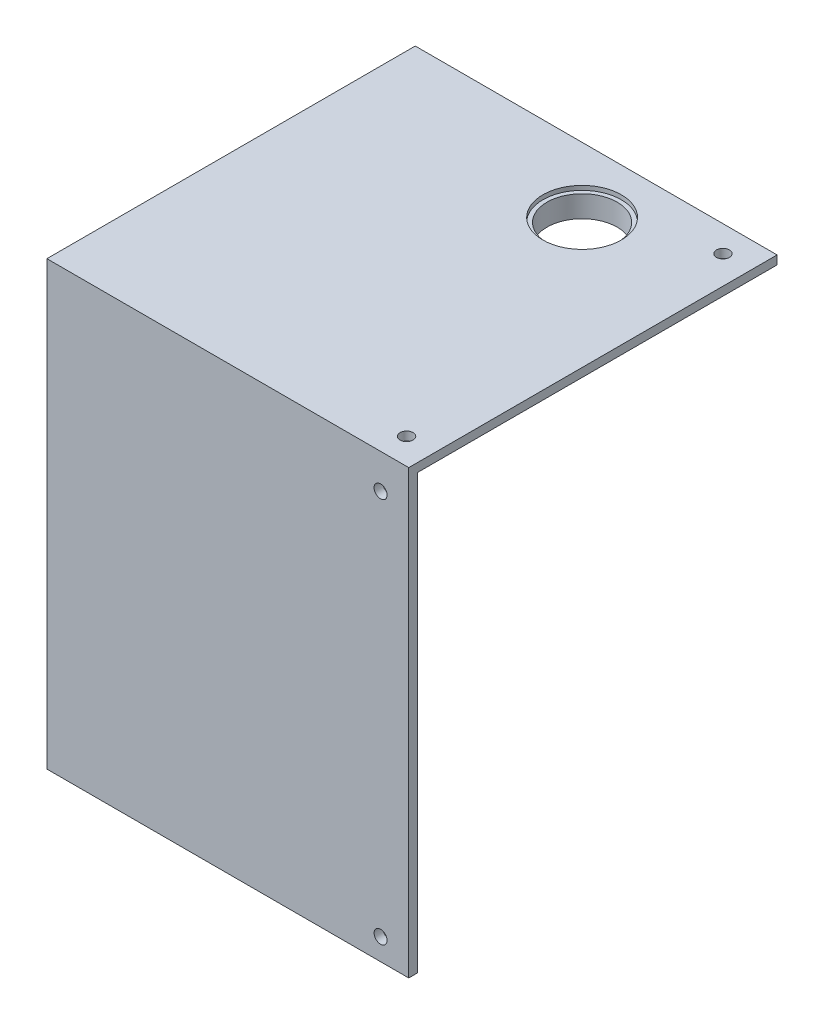
ISO-10303-21;
HEADER;
FILE_DESCRIPTION(('STEP AP214'),'2;1');
FILE_NAME('part.step','',(''),(''),'','','');
FILE_SCHEMA(('AUTOMOTIVE_DESIGN { 1 0 10303 214 1 1 1 1 }'));
ENDSEC;
DATA;
#1=APPLICATION_CONTEXT('core data for automotive mechanical design processes');
#2=APPLICATION_PROTOCOL_DEFINITION('international standard','automotive_design',2000,#1);
#3=PRODUCT_CONTEXT('',#1,'mechanical');
#4=PRODUCT('Part','Part','',(#3));
#5=PRODUCT_RELATED_PRODUCT_CATEGORY('part','',(#4));
#6=PRODUCT_DEFINITION_FORMATION('','',#4);
#7=PRODUCT_DEFINITION_CONTEXT('part definition',#1,'design');
#8=PRODUCT_DEFINITION('design','',#6,#7);
#9=PRODUCT_DEFINITION_SHAPE('','',#8);
#10=(LENGTH_UNIT() NAMED_UNIT(*) SI_UNIT(.MILLI.,.METRE.));
#11=(NAMED_UNIT(*) PLANE_ANGLE_UNIT() SI_UNIT($,.RADIAN.));
#12=(NAMED_UNIT(*) SI_UNIT($,.STERADIAN.) SOLID_ANGLE_UNIT());
#13=UNCERTAINTY_MEASURE_WITH_UNIT(LENGTH_MEASURE(1.E-05),#10,'distance_accuracy_value','');
#14=(GEOMETRIC_REPRESENTATION_CONTEXT(3) GLOBAL_UNCERTAINTY_ASSIGNED_CONTEXT((#13)) GLOBAL_UNIT_ASSIGNED_CONTEXT((#10,
#11,#12)) REPRESENTATION_CONTEXT('',''));
#15=CARTESIAN_POINT('',(0.,0.,0.));
#16=DIRECTION('',(0.,0.,1.));
#17=DIRECTION('',(1.,0.,0.));
#18=AXIS2_PLACEMENT_3D('',#15,#16,#17);
#19=CARTESIAN_POINT('',(11.75,2.,-27.5));
#20=DIRECTION('',(0.,-1.,0.));
#21=DIRECTION('',(0.,0.,-1.));
#22=AXIS2_PLACEMENT_3D('',#19,#20,#21);
#23=CYLINDRICAL_SURFACE('',#22,8.1);
#24=CARTESIAN_POINT('',(11.75,-4.,-27.5));
#25=DIRECTION('',(0.,-1.,0.));
#26=DIRECTION('',(0.,0.,-1.));
#27=AXIS2_PLACEMENT_3D('',#24,#25,#26);
#28=CIRCLE('',#27,8.1);
#29=CARTESIAN_POINT('',(11.75,-4.,-35.6));
#30=VERTEX_POINT('',#29);
#31=EDGE_CURVE('E160',#30,#30,#28,.T.);
#32=ORIENTED_EDGE('',*,*,#31,.T.);
#33=EDGE_LOOP('',(#32));
#34=FACE_BOUND('',#33,.T.);
#35=CARTESIAN_POINT('',(11.75,1.,-27.5));
#36=DIRECTION('',(0.,1.,0.));
#37=DIRECTION('',(0.,0.,1.));
#38=AXIS2_PLACEMENT_3D('',#35,#36,#37);
#39=CIRCLE('',#38,8.1);
#40=CARTESIAN_POINT('',(11.75,1.,-19.4));
#41=VERTEX_POINT('',#40);
#42=EDGE_CURVE('E45',#41,#41,#39,.F.);
#43=ORIENTED_EDGE('',*,*,#42,.F.);
#44=EDGE_LOOP('',(#43));
#45=FACE_BOUND('',#44,.T.);
#46=ADVANCED_FACE('F41',(#34,#45),#23,.F.);
#47=CARTESIAN_POINT('',(41.75,2.,42.5));
#48=DIRECTION('',(-1.,0.,0.));
#49=DIRECTION('',(0.,0.,1.));
#50=AXIS2_PLACEMENT_3D('',#47,#48,#49);
#51=PLANE('',#50);
#52=DIRECTION('',(0.,-1.,0.));
#53=VECTOR('',#52,1.);
#54=CARTESIAN_POINT('',(41.75,2.,42.5));
#55=LINE('',#54,#53);
#56=CARTESIAN_POINT('',(41.75,2.,42.5));
#57=VERTEX_POINT('',#56);
#58=CARTESIAN_POINT('',(41.75,-100.,42.5));
#59=VERTEX_POINT('',#58);
#60=EDGE_CURVE('E148',#57,#59,#55,.T.);
#61=ORIENTED_EDGE('',*,*,#60,.T.);
#62=DIRECTION('',(0.,0.,1.));
#63=VECTOR('',#62,1.);
#64=CARTESIAN_POINT('',(41.75,-100.,42.5));
#65=LINE('',#64,#63);
#66=CARTESIAN_POINT('',(41.75,-100.,40.5));
#67=VERTEX_POINT('',#66);
#68=EDGE_CURVE('E116',#67,#59,#65,.T.);
#69=ORIENTED_EDGE('',*,*,#68,.F.);
#70=DIRECTION('',(0.,1.,0.));
#71=VECTOR('',#70,1.);
#72=CARTESIAN_POINT('',(41.75,-100.,40.5));
#73=LINE('',#72,#71);
#74=CARTESIAN_POINT('',(41.75,0.,40.5));
#75=VERTEX_POINT('',#74);
#76=EDGE_CURVE('E111',#67,#75,#73,.T.);
#77=ORIENTED_EDGE('',*,*,#76,.T.);
#78=DIRECTION('',(0.,0.,-1.));
#79=VECTOR('',#78,1.);
#80=CARTESIAN_POINT('',(41.75,0.,42.5));
#81=LINE('',#80,#79);
#82=CARTESIAN_POINT('',(41.75,0.,-42.5));
#83=VERTEX_POINT('',#82);
#84=EDGE_CURVE('E131',#75,#83,#81,.T.);
#85=ORIENTED_EDGE('',*,*,#84,.T.);
#86=DIRECTION('',(0.,-1.,0.));
#87=VECTOR('',#86,1.);
#88=CARTESIAN_POINT('',(41.75,2.,-42.5));
#89=LINE('',#88,#87);
#90=CARTESIAN_POINT('',(41.75,2.,-42.5));
#91=VERTEX_POINT('',#90);
#92=EDGE_CURVE('E11',#91,#83,#89,.T.);
#93=ORIENTED_EDGE('',*,*,#92,.F.);
#94=DIRECTION('',(0.,0.,-1.));
#95=VECTOR('',#94,1.);
#96=CARTESIAN_POINT('',(41.75,2.,42.5));
#97=LINE('',#96,#95);
#98=EDGE_CURVE('E139',#57,#91,#97,.T.);
#99=ORIENTED_EDGE('',*,*,#98,.F.);
#100=EDGE_LOOP('',(#61,#69,#77,#85,#93,#99));
#101=FACE_BOUND('',#100,.T.);
#102=ADVANCED_FACE('F43',(#101),#51,.F.);
#103=CARTESIAN_POINT('',(-41.75,2.,-42.5));
#104=DIRECTION('',(0.,0.,1.));
#105=DIRECTION('',(1.,0.,0.));
#106=AXIS2_PLACEMENT_3D('',#103,#104,#105);
#107=PLANE('',#106);
#108=DIRECTION('',(-1.,0.,0.));
#109=VECTOR('',#108,1.);
#110=CARTESIAN_POINT('',(-41.75,0.,-42.5));
#111=LINE('',#110,#109);
#112=CARTESIAN_POINT('',(-41.75,0.,-42.5));
#113=VERTEX_POINT('',#112);
#114=EDGE_CURVE('E83',#83,#113,#111,.T.);
#115=ORIENTED_EDGE('',*,*,#114,.T.);
#116=DIRECTION('',(0.,-1.,0.));
#117=VECTOR('',#116,1.);
#118=CARTESIAN_POINT('',(-41.75,2.,-42.5));
#119=LINE('',#118,#117);
#120=CARTESIAN_POINT('',(-41.75,2.,-42.5));
#121=VERTEX_POINT('',#120);
#122=EDGE_CURVE('E51',#121,#113,#119,.T.);
#123=ORIENTED_EDGE('',*,*,#122,.F.);
#124=DIRECTION('',(-1.,0.,0.));
#125=VECTOR('',#124,1.);
#126=CARTESIAN_POINT('',(-41.75,2.,-42.5));
#127=LINE('',#126,#125);
#128=EDGE_CURVE('E88',#91,#121,#127,.T.);
#129=ORIENTED_EDGE('',*,*,#128,.F.);
#130=ORIENTED_EDGE('',*,*,#92,.T.);
#131=EDGE_LOOP('',(#115,#123,#129,#130));
#132=FACE_BOUND('',#131,.T.);
#133=ADVANCED_FACE('F203',(#132),#107,.F.);
#134=CARTESIAN_POINT('',(-41.75,2.,42.5));
#135=DIRECTION('',(1.,0.,0.));
#136=DIRECTION('',(0.,0.,-1.));
#137=AXIS2_PLACEMENT_3D('',#134,#135,#136);
#138=PLANE('',#137);
#139=DIRECTION('',(0.,0.,1.));
#140=VECTOR('',#139,1.);
#141=CARTESIAN_POINT('',(-41.75,0.,42.5));
#142=LINE('',#141,#140);
#143=CARTESIAN_POINT('',(-41.75,0.,40.5));
#144=VERTEX_POINT('',#143);
#145=EDGE_CURVE('E129',#113,#144,#142,.T.);
#146=ORIENTED_EDGE('',*,*,#145,.T.);
#147=DIRECTION('',(0.,1.,0.));
#148=VECTOR('',#147,1.);
#149=CARTESIAN_POINT('',(-41.75,-100.,40.5));
#150=LINE('',#149,#148);
#151=CARTESIAN_POINT('',(-41.75,-100.,40.5));
#152=VERTEX_POINT('',#151);
#153=EDGE_CURVE('E109',#152,#144,#150,.T.);
#154=ORIENTED_EDGE('',*,*,#153,.F.);
#155=DIRECTION('',(0.,0.,-1.));
#156=VECTOR('',#155,1.);
#157=CARTESIAN_POINT('',(-41.75,-100.,42.5));
#158=LINE('',#157,#156);
#159=CARTESIAN_POINT('',(-41.75,-100.,42.5));
#160=VERTEX_POINT('',#159);
#161=EDGE_CURVE('E117',#160,#152,#158,.T.);
#162=ORIENTED_EDGE('',*,*,#161,.F.);
#163=DIRECTION('',(0.,-1.,0.));
#164=VECTOR('',#163,1.);
#165=CARTESIAN_POINT('',(-41.75,2.,42.5));
#166=LINE('',#165,#164);
#167=CARTESIAN_POINT('',(-41.75,2.,42.5));
#168=VERTEX_POINT('',#167);
#169=EDGE_CURVE('E156',#168,#160,#166,.T.);
#170=ORIENTED_EDGE('',*,*,#169,.F.);
#171=DIRECTION('',(0.,0.,1.));
#172=VECTOR('',#171,1.);
#173=CARTESIAN_POINT('',(-41.75,2.,42.5));
#174=LINE('',#173,#172);
#175=EDGE_CURVE('E144',#121,#168,#174,.T.);
#176=ORIENTED_EDGE('',*,*,#175,.F.);
#177=ORIENTED_EDGE('',*,*,#122,.T.);
#178=EDGE_LOOP('',(#146,#154,#162,#170,#176,#177));
#179=FACE_BOUND('',#178,.T.);
#180=ADVANCED_FACE('F128',(#179),#138,.F.);
#181=CARTESIAN_POINT('',(-41.75,2.,42.5));
#182=DIRECTION('',(0.,0.,-1.));
#183=DIRECTION('',(-1.,0.,0.));
#184=AXIS2_PLACEMENT_3D('',#181,#182,#183);
#185=PLANE('',#184);
#186=CARTESIAN_POINT('',(35.25,-95.,42.5));
#187=DIRECTION('',(0.,0.,1.));
#188=DIRECTION('',(1.,0.,0.));
#189=AXIS2_PLACEMENT_3D('',#186,#187,#188);
#190=CIRCLE('',#189,1.5);
#191=CARTESIAN_POINT('',(36.75,-95.,42.5));
#192=VERTEX_POINT('',#191);
#193=EDGE_CURVE('E247',#192,#192,#190,.T.);
#194=ORIENTED_EDGE('',*,*,#193,.F.);
#195=EDGE_LOOP('',(#194));
#196=FACE_BOUND('',#195,.T.);
#197=CARTESIAN_POINT('',(35.25,-6.,42.5));
#198=DIRECTION('',(0.,0.,1.));
#199=DIRECTION('',(1.,0.,0.));
#200=AXIS2_PLACEMENT_3D('',#197,#198,#199);
#201=CIRCLE('',#200,1.5);
#202=CARTESIAN_POINT('',(36.75,-6.,42.5));
#203=VERTEX_POINT('',#202);
#204=EDGE_CURVE('E250',#203,#203,#201,.T.);
#205=ORIENTED_EDGE('',*,*,#204,.F.);
#206=EDGE_LOOP('',(#205));
#207=FACE_BOUND('',#206,.T.);
#208=ORIENTED_EDGE('',*,*,#169,.T.);
#209=DIRECTION('',(-1.,0.,0.));
#210=VECTOR('',#209,1.);
#211=CARTESIAN_POINT('',(-41.75,-100.,42.5));
#212=LINE('',#211,#210);
#213=EDGE_CURVE('E123',#59,#160,#212,.T.);
#214=ORIENTED_EDGE('',*,*,#213,.F.);
#215=ORIENTED_EDGE('',*,*,#60,.F.);
#216=DIRECTION('',(1.,0.,0.));
#217=VECTOR('',#216,1.);
#218=CARTESIAN_POINT('',(-41.75,2.,42.5));
#219=LINE('',#218,#217);
#220=EDGE_CURVE('E68',#168,#57,#219,.T.);
#221=ORIENTED_EDGE('',*,*,#220,.F.);
#222=EDGE_LOOP('',(#208,#214,#215,#221));
#223=FACE_BOUND('',#222,.T.);
#224=ADVANCED_FACE('F200',(#196,#207,#223),#185,.F.);
#225=CARTESIAN_POINT('',(0.,2.,0.));
#226=DIRECTION('',(0.,-1.,0.));
#227=DIRECTION('',(0.,0.,-1.));
#228=AXIS2_PLACEMENT_3D('',#225,#226,#227);
#229=PLANE('',#228);
#230=CARTESIAN_POINT('',(35.25,2.,36.5));
#231=DIRECTION('',(0.,1.,0.));
#232=DIRECTION('',(0.,0.,1.));
#233=AXIS2_PLACEMENT_3D('',#230,#231,#232);
#234=CIRCLE('',#233,1.5);
#235=CARTESIAN_POINT('',(35.25,2.,38.));
#236=VERTEX_POINT('',#235);
#237=EDGE_CURVE('E253',#236,#236,#234,.T.);
#238=ORIENTED_EDGE('',*,*,#237,.F.);
#239=EDGE_LOOP('',(#238));
#240=FACE_BOUND('',#239,.T.);
#241=CARTESIAN_POINT('',(35.25,2.,-36.5));
#242=DIRECTION('',(0.,1.,0.));
#243=DIRECTION('',(0.,0.,1.));
#244=AXIS2_PLACEMENT_3D('',#241,#242,#243);
#245=CIRCLE('',#244,1.5);
#246=CARTESIAN_POINT('',(35.25,2.,-35.));
#247=VERTEX_POINT('',#246);
#248=EDGE_CURVE('E270',#247,#247,#245,.T.);
#249=ORIENTED_EDGE('',*,*,#248,.F.);
#250=EDGE_LOOP('',(#249));
#251=FACE_BOUND('',#250,.T.);
#252=CARTESIAN_POINT('',(11.75,2.,-27.5));
#253=DIRECTION('',(0.,1.,0.));
#254=DIRECTION('',(0.,0.,1.));
#255=AXIS2_PLACEMENT_3D('',#252,#253,#254);
#256=CIRCLE('',#255,9.05);
#257=CARTESIAN_POINT('',(11.75,2.,-18.45));
#258=VERTEX_POINT('',#257);
#259=EDGE_CURVE('E177',#258,#258,#256,.T.);
#260=ORIENTED_EDGE('',*,*,#259,.F.);
#261=EDGE_LOOP('',(#260));
#262=FACE_BOUND('',#261,.T.);
#263=ORIENTED_EDGE('',*,*,#98,.T.);
#264=ORIENTED_EDGE('',*,*,#128,.T.);
#265=ORIENTED_EDGE('',*,*,#175,.T.);
#266=ORIENTED_EDGE('',*,*,#220,.T.);
#267=EDGE_LOOP('',(#263,#264,#265,#266));
#268=FACE_BOUND('',#267,.T.);
#269=ADVANCED_FACE('F202',(#240,#251,#262,#268),#229,.F.);
#270=CARTESIAN_POINT('',(0.,0.,0.));
#271=DIRECTION('',(0.,-1.,0.));
#272=DIRECTION('',(0.,0.,-1.));
#273=AXIS2_PLACEMENT_3D('',#270,#271,#272);
#274=PLANE('',#273);
#275=CARTESIAN_POINT('',(35.25,0.,36.5));
#276=DIRECTION('',(0.,-1.,0.));
#277=DIRECTION('',(0.,0.,-1.));
#278=AXIS2_PLACEMENT_3D('',#275,#276,#277);
#279=CIRCLE('',#278,1.5);
#280=CARTESIAN_POINT('',(35.25,0.,35.));
#281=VERTEX_POINT('',#280);
#282=EDGE_CURVE('E258',#281,#281,#279,.F.);
#283=ORIENTED_EDGE('',*,*,#282,.T.);
#284=EDGE_LOOP('',(#283));
#285=FACE_BOUND('',#284,.T.);
#286=CARTESIAN_POINT('',(35.25,0.,-36.5));
#287=DIRECTION('',(0.,-1.,0.));
#288=DIRECTION('',(0.,0.,-1.));
#289=AXIS2_PLACEMENT_3D('',#286,#287,#288);
#290=CIRCLE('',#289,1.5);
#291=CARTESIAN_POINT('',(35.25,0.,-38.));
#292=VERTEX_POINT('',#291);
#293=EDGE_CURVE('E266',#292,#292,#290,.F.);
#294=ORIENTED_EDGE('',*,*,#293,.T.);
#295=EDGE_LOOP('',(#294));
#296=FACE_BOUND('',#295,.T.);
#297=CARTESIAN_POINT('',(11.75,0.,-27.5));
#298=DIRECTION('',(0.,-1.,0.));
#299=DIRECTION('',(0.,0.,-1.));
#300=AXIS2_PLACEMENT_3D('',#297,#298,#299);
#301=CIRCLE('',#300,10.6);
#302=CARTESIAN_POINT('',(11.75,0.,-38.1));
#303=VERTEX_POINT('',#302);
#304=EDGE_CURVE('E163',#303,#303,#301,.T.);
#305=ORIENTED_EDGE('',*,*,#304,.F.);
#306=EDGE_LOOP('',(#305));
#307=FACE_BOUND('',#306,.T.);
#308=DIRECTION('',(1.,0.,0.));
#309=VECTOR('',#308,1.);
#310=CARTESIAN_POINT('',(-41.75,0.,40.5));
#311=LINE('',#310,#309);
#312=EDGE_CURVE('E59',#144,#75,#311,.T.);
#313=ORIENTED_EDGE('',*,*,#312,.F.);
#314=ORIENTED_EDGE('',*,*,#145,.F.);
#315=ORIENTED_EDGE('',*,*,#114,.F.);
#316=ORIENTED_EDGE('',*,*,#84,.F.);
#317=EDGE_LOOP('',(#313,#314,#315,#316));
#318=FACE_BOUND('',#317,.T.);
#319=ADVANCED_FACE('F232',(#285,#296,#307,#318),#274,.T.);
#320=CARTESIAN_POINT('',(-41.75,-100.,40.5));
#321=DIRECTION('',(0.,0.,1.));
#322=DIRECTION('',(1.,0.,0.));
#323=AXIS2_PLACEMENT_3D('',#320,#321,#322);
#324=PLANE('',#323);
#325=CARTESIAN_POINT('',(35.25,-95.,40.5));
#326=DIRECTION('',(0.,0.,1.));
#327=DIRECTION('',(1.,0.,0.));
#328=AXIS2_PLACEMENT_3D('',#325,#326,#327);
#329=CIRCLE('',#328,1.5);
#330=CARTESIAN_POINT('',(36.75,-95.,40.5));
#331=VERTEX_POINT('',#330);
#332=EDGE_CURVE('E183',#331,#331,#329,.F.);
#333=ORIENTED_EDGE('',*,*,#332,.F.);
#334=EDGE_LOOP('',(#333));
#335=FACE_BOUND('',#334,.T.);
#336=CARTESIAN_POINT('',(35.25,-6.,40.5));
#337=DIRECTION('',(0.,0.,1.));
#338=DIRECTION('',(1.,0.,0.));
#339=AXIS2_PLACEMENT_3D('',#336,#337,#338);
#340=CIRCLE('',#339,1.5);
#341=CARTESIAN_POINT('',(36.75,-6.,40.5));
#342=VERTEX_POINT('',#341);
#343=EDGE_CURVE('E186',#342,#342,#340,.F.);
#344=ORIENTED_EDGE('',*,*,#343,.F.);
#345=EDGE_LOOP('',(#344));
#346=FACE_BOUND('',#345,.T.);
#347=ORIENTED_EDGE('',*,*,#312,.T.);
#348=ORIENTED_EDGE('',*,*,#76,.F.);
#349=DIRECTION('',(1.,0.,0.));
#350=VECTOR('',#349,1.);
#351=CARTESIAN_POINT('',(-41.75,-100.,40.5));
#352=LINE('',#351,#350);
#353=EDGE_CURVE('E105',#152,#67,#352,.T.);
#354=ORIENTED_EDGE('',*,*,#353,.F.);
#355=ORIENTED_EDGE('',*,*,#153,.T.);
#356=EDGE_LOOP('',(#347,#348,#354,#355));
#357=FACE_BOUND('',#356,.T.);
#358=ADVANCED_FACE('F107',(#335,#346,#357),#324,.F.);
#359=CARTESIAN_POINT('',(0.,-100.,0.));
#360=DIRECTION('',(0.,-1.,0.));
#361=DIRECTION('',(0.,0.,-1.));
#362=AXIS2_PLACEMENT_3D('',#359,#360,#361);
#363=PLANE('',#362);
#364=ORIENTED_EDGE('',*,*,#161,.T.);
#365=ORIENTED_EDGE('',*,*,#353,.T.);
#366=ORIENTED_EDGE('',*,*,#68,.T.);
#367=ORIENTED_EDGE('',*,*,#213,.T.);
#368=EDGE_LOOP('',(#364,#365,#366,#367));
#369=FACE_BOUND('',#368,.T.);
#370=ADVANCED_FACE('F121',(#369),#363,.T.);
#371=CARTESIAN_POINT('',(11.75,-4.,-27.5));
#372=DIRECTION('',(0.,1.,0.));
#373=DIRECTION('',(0.,0.,1.));
#374=AXIS2_PLACEMENT_3D('',#371,#372,#373);
#375=CYLINDRICAL_SURFACE('',#374,10.6);
#376=CARTESIAN_POINT('',(11.75,-4.,-27.5));
#377=DIRECTION('',(0.,-1.,0.));
#378=DIRECTION('',(0.,0.,-1.));
#379=AXIS2_PLACEMENT_3D('',#376,#377,#378);
#380=CIRCLE('',#379,10.6);
#381=CARTESIAN_POINT('',(11.75,-4.,-38.1));
#382=VERTEX_POINT('',#381);
#383=EDGE_CURVE('E169',#382,#382,#380,.T.);
#384=ORIENTED_EDGE('',*,*,#383,.F.);
#385=EDGE_LOOP('',(#384));
#386=FACE_BOUND('',#385,.T.);
#387=ORIENTED_EDGE('',*,*,#304,.T.);
#388=EDGE_LOOP('',(#387));
#389=FACE_BOUND('',#388,.T.);
#390=ADVANCED_FACE('F223',(#386,#389),#375,.T.);
#391=CARTESIAN_POINT('',(0.,-4.,0.));
#392=DIRECTION('',(0.,-1.,0.));
#393=DIRECTION('',(0.,0.,-1.));
#394=AXIS2_PLACEMENT_3D('',#391,#392,#393);
#395=PLANE('',#394);
#396=ORIENTED_EDGE('',*,*,#31,.F.);
#397=EDGE_LOOP('',(#396));
#398=FACE_BOUND('',#397,.T.);
#399=ORIENTED_EDGE('',*,*,#383,.T.);
#400=EDGE_LOOP('',(#399));
#401=FACE_BOUND('',#400,.T.);
#402=ADVANCED_FACE('F219',(#398,#401),#395,.T.);
#403=CARTESIAN_POINT('',(11.75,1.,-27.5));
#404=DIRECTION('',(0.,1.,0.));
#405=DIRECTION('',(0.,0.,1.));
#406=AXIS2_PLACEMENT_3D('',#403,#404,#405);
#407=PLANE('',#406);
#408=CARTESIAN_POINT('',(11.75,1.,-27.5));
#409=DIRECTION('',(0.,1.,0.));
#410=DIRECTION('',(0.,0.,1.));
#411=AXIS2_PLACEMENT_3D('',#408,#409,#410);
#412=CIRCLE('',#411,9.05);
#413=CARTESIAN_POINT('',(11.75,1.,-18.45));
#414=VERTEX_POINT('',#413);
#415=EDGE_CURVE('E172',#414,#414,#412,.T.);
#416=ORIENTED_EDGE('',*,*,#415,.T.);
#417=EDGE_LOOP('',(#416));
#418=FACE_BOUND('',#417,.T.);
#419=ORIENTED_EDGE('',*,*,#42,.T.);
#420=EDGE_LOOP('',(#419));
#421=FACE_BOUND('',#420,.T.);
#422=ADVANCED_FACE('F222',(#418,#421),#407,.T.);
#423=CARTESIAN_POINT('',(11.75,1.,-27.5));
#424=DIRECTION('',(0.,1.,0.));
#425=DIRECTION('',(0.,0.,1.));
#426=AXIS2_PLACEMENT_3D('',#423,#424,#425);
#427=CYLINDRICAL_SURFACE('',#426,9.05);
#428=ORIENTED_EDGE('',*,*,#415,.F.);
#429=EDGE_LOOP('',(#428));
#430=FACE_BOUND('',#429,.T.);
#431=ORIENTED_EDGE('',*,*,#259,.T.);
#432=EDGE_LOOP('',(#431));
#433=FACE_BOUND('',#432,.T.);
#434=ADVANCED_FACE('F217',(#430,#433),#427,.F.);
#435=CARTESIAN_POINT('',(35.25,-6.,-42.501));
#436=DIRECTION('',(0.,0.,1.));
#437=DIRECTION('',(1.,0.,0.));
#438=AXIS2_PLACEMENT_3D('',#435,#436,#437);
#439=CYLINDRICAL_SURFACE('',#438,1.5);
#440=ORIENTED_EDGE('',*,*,#204,.T.);
#441=EDGE_LOOP('',(#440));
#442=FACE_BOUND('',#441,.T.);
#443=ORIENTED_EDGE('',*,*,#343,.T.);
#444=EDGE_LOOP('',(#443));
#445=FACE_BOUND('',#444,.T.);
#446=ADVANCED_FACE('F291',(#442,#445),#439,.F.);
#447=CARTESIAN_POINT('',(35.25,-95.,-42.501));
#448=DIRECTION('',(0.,0.,1.));
#449=DIRECTION('',(1.,0.,0.));
#450=AXIS2_PLACEMENT_3D('',#447,#448,#449);
#451=CYLINDRICAL_SURFACE('',#450,1.5);
#452=ORIENTED_EDGE('',*,*,#193,.T.);
#453=EDGE_LOOP('',(#452));
#454=FACE_BOUND('',#453,.T.);
#455=ORIENTED_EDGE('',*,*,#332,.T.);
#456=EDGE_LOOP('',(#455));
#457=FACE_BOUND('',#456,.T.);
#458=ADVANCED_FACE('F297',(#454,#457),#451,.F.);
#459=CARTESIAN_POINT('',(35.25,-100.001,-36.5));
#460=DIRECTION('',(0.,1.,0.));
#461=DIRECTION('',(0.,0.,1.));
#462=AXIS2_PLACEMENT_3D('',#459,#460,#461);
#463=CYLINDRICAL_SURFACE('',#462,1.5);
#464=ORIENTED_EDGE('',*,*,#293,.F.);
#465=EDGE_LOOP('',(#464));
#466=FACE_BOUND('',#465,.T.);
#467=ORIENTED_EDGE('',*,*,#248,.T.);
#468=EDGE_LOOP('',(#467));
#469=FACE_BOUND('',#468,.T.);
#470=ADVANCED_FACE('F282',(#466,#469),#463,.F.);
#471=CARTESIAN_POINT('',(35.25,-100.001,36.5));
#472=DIRECTION('',(0.,1.,0.));
#473=DIRECTION('',(0.,0.,1.));
#474=AXIS2_PLACEMENT_3D('',#471,#472,#473);
#475=CYLINDRICAL_SURFACE('',#474,1.5);
#476=ORIENTED_EDGE('',*,*,#282,.F.);
#477=EDGE_LOOP('',(#476));
#478=FACE_BOUND('',#477,.T.);
#479=ORIENTED_EDGE('',*,*,#237,.T.);
#480=EDGE_LOOP('',(#479));
#481=FACE_BOUND('',#480,.T.);
#482=ADVANCED_FACE('F279',(#478,#481),#475,.F.);
#483=CLOSED_SHELL('',(#46,#102,#133,#180,#224,#269,#319,#358,#370,#390,#402,#422,#434,#446,#458,
#470,#482));
#484=MANIFOLD_SOLID_BREP('B2',#483);
#485=ADVANCED_BREP_SHAPE_REPRESENTATION('',(#18,#484),#14);
#486=SHAPE_DEFINITION_REPRESENTATION(#9,#485);
ENDSEC;
END-ISO-10303-21;
